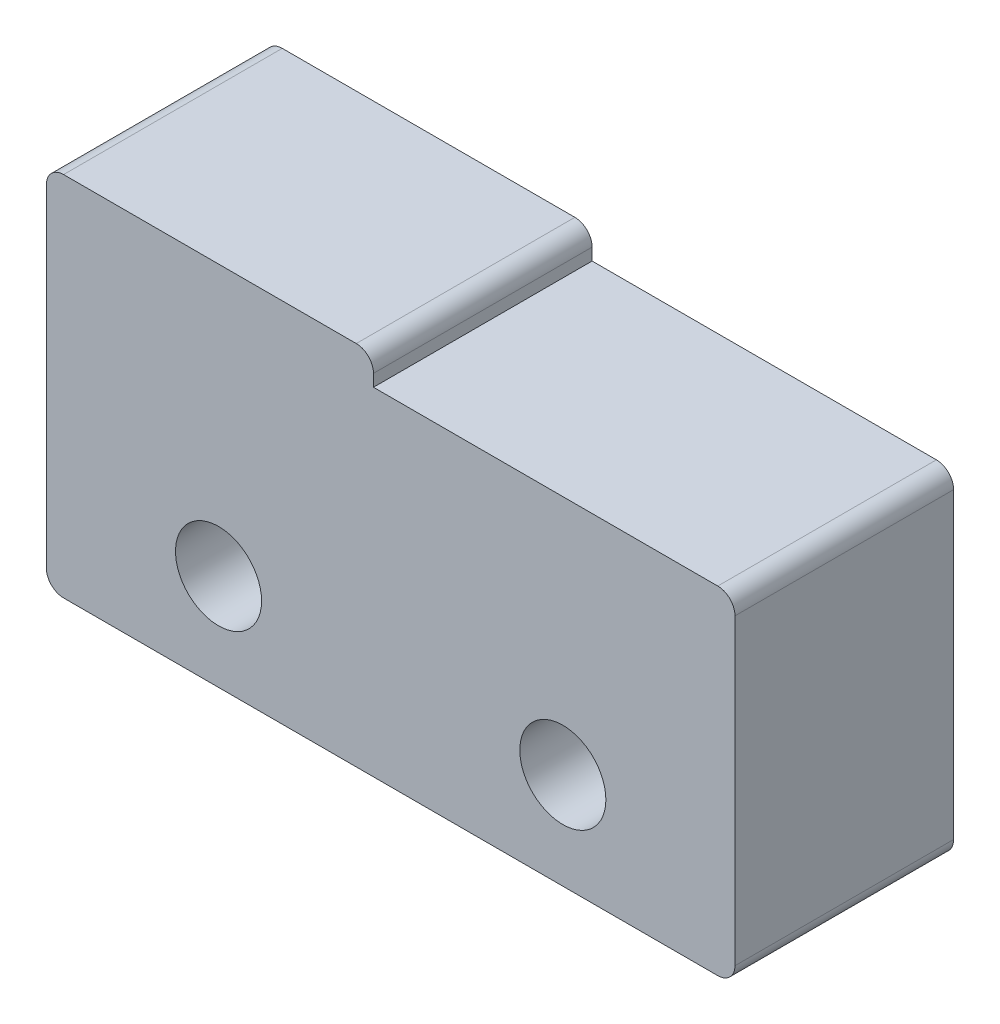
ISO-10303-21;
HEADER;
FILE_DESCRIPTION(('STEP AP214'),'2;1');
FILE_NAME('part.step','',(''),(''),'','','');
FILE_SCHEMA(('AUTOMOTIVE_DESIGN { 1 0 10303 214 1 1 1 1 }'));
ENDSEC;
DATA;
#1=APPLICATION_CONTEXT('core data for automotive mechanical design processes');
#2=APPLICATION_PROTOCOL_DEFINITION('international standard','automotive_design',2000,#1);
#3=PRODUCT_CONTEXT('',#1,'mechanical');
#4=PRODUCT('Part','Part','',(#3));
#5=PRODUCT_RELATED_PRODUCT_CATEGORY('part','',(#4));
#6=PRODUCT_DEFINITION_FORMATION('','',#4);
#7=PRODUCT_DEFINITION_CONTEXT('part definition',#1,'design');
#8=PRODUCT_DEFINITION('design','',#6,#7);
#9=PRODUCT_DEFINITION_SHAPE('','',#8);
#10=(LENGTH_UNIT() NAMED_UNIT(*) SI_UNIT(.MILLI.,.METRE.));
#11=(NAMED_UNIT(*) PLANE_ANGLE_UNIT() SI_UNIT($,.RADIAN.));
#12=(NAMED_UNIT(*) SI_UNIT($,.STERADIAN.) SOLID_ANGLE_UNIT());
#13=UNCERTAINTY_MEASURE_WITH_UNIT(LENGTH_MEASURE(1.E-05),#10,'distance_accuracy_value','');
#14=(GEOMETRIC_REPRESENTATION_CONTEXT(3) GLOBAL_UNCERTAINTY_ASSIGNED_CONTEXT((#13)) GLOBAL_UNIT_ASSIGNED_CONTEXT((#10,
#11,#12)) REPRESENTATION_CONTEXT('',''));
#15=CARTESIAN_POINT('',(0.,0.,0.));
#16=DIRECTION('',(0.,0.,1.));
#17=DIRECTION('',(1.,0.,0.));
#18=AXIS2_PLACEMENT_3D('',#15,#16,#17);
#19=CARTESIAN_POINT('',(0.,0.,6.35));
#20=DIRECTION('',(0.,0.,-1.));
#21=DIRECTION('',(-1.,0.,0.));
#22=AXIS2_PLACEMENT_3D('',#19,#20,#21);
#23=PLANE('',#22);
#24=CARTESIAN_POINT('',(-5.,-2.2,6.35));
#25=DIRECTION('',(0.,0.,1.));
#26=DIRECTION('',(1.,0.,0.));
#27=AXIS2_PLACEMENT_3D('',#24,#25,#26);
#28=CIRCLE('',#27,1.25);
#29=CARTESIAN_POINT('',(-3.75,-2.2,6.35));
#30=VERTEX_POINT('',#29);
#31=EDGE_CURVE('E148',#30,#30,#28,.T.);
#32=ORIENTED_EDGE('',*,*,#31,.F.);
#33=EDGE_LOOP('',(#32));
#34=FACE_BOUND('',#33,.T.);
#35=DIRECTION('',(1.,0.,0.));
#36=VECTOR('',#35,1.);
#37=CARTESIAN_POINT('',(10.,-5.,6.35));
#38=LINE('',#37,#36);
#39=CARTESIAN_POINT('',(-9.5,-5.,6.35));
#40=VERTEX_POINT('',#39);
#41=CARTESIAN_POINT('',(9.5,-5.,6.35));
#42=VERTEX_POINT('',#41);
#43=EDGE_CURVE('E215',#40,#42,#38,.T.);
#44=ORIENTED_EDGE('',*,*,#43,.T.);
#45=CARTESIAN_POINT('',(9.5,-4.5,6.35));
#46=DIRECTION('',(0.,0.,-1.));
#47=DIRECTION('',(-1.,0.,0.));
#48=AXIS2_PLACEMENT_3D('',#45,#46,#47);
#49=CIRCLE('',#48,0.5);
#50=CARTESIAN_POINT('',(10.,-4.5,6.35));
#51=VERTEX_POINT('',#50);
#52=EDGE_CURVE('E185',#42,#51,#49,.F.);
#53=ORIENTED_EDGE('',*,*,#52,.T.);
#54=DIRECTION('',(0.,1.,0.));
#55=VECTOR('',#54,1.);
#56=CARTESIAN_POINT('',(10.,4.8,6.35));
#57=LINE('',#56,#55);
#58=CARTESIAN_POINT('',(10.,4.3,6.35));
#59=VERTEX_POINT('',#58);
#60=EDGE_CURVE('E125',#51,#59,#57,.T.);
#61=ORIENTED_EDGE('',*,*,#60,.T.);
#62=CARTESIAN_POINT('',(9.5,4.3,6.35));
#63=DIRECTION('',(0.,0.,-1.));
#64=DIRECTION('',(-1.,0.,0.));
#65=AXIS2_PLACEMENT_3D('',#62,#63,#64);
#66=CIRCLE('',#65,0.5);
#67=CARTESIAN_POINT('',(9.5,4.8,6.35));
#68=VERTEX_POINT('',#67);
#69=EDGE_CURVE('E121',#59,#68,#66,.F.);
#70=ORIENTED_EDGE('',*,*,#69,.T.);
#71=DIRECTION('',(-1.,0.,0.));
#72=VECTOR('',#71,1.);
#73=CARTESIAN_POINT('',(10.,4.8,6.35));
#74=LINE('',#73,#72);
#75=CARTESIAN_POINT('',(-0.5,4.8,6.35));
#76=VERTEX_POINT('',#75);
#77=EDGE_CURVE('E113',#68,#76,#74,.T.);
#78=ORIENTED_EDGE('',*,*,#77,.T.);
#79=DIRECTION('',(0.,1.,0.));
#80=VECTOR('',#79,1.);
#81=CARTESIAN_POINT('',(-0.5,5.65,6.35));
#82=LINE('',#81,#80);
#83=CARTESIAN_POINT('',(-0.5,5.15,6.35));
#84=VERTEX_POINT('',#83);
#85=EDGE_CURVE('E118',#76,#84,#82,.T.);
#86=ORIENTED_EDGE('',*,*,#85,.T.);
#87=CARTESIAN_POINT('',(-1.,5.15,6.35));
#88=DIRECTION('',(0.,0.,-1.));
#89=DIRECTION('',(-1.,0.,0.));
#90=AXIS2_PLACEMENT_3D('',#87,#88,#89);
#91=CIRCLE('',#90,0.5);
#92=CARTESIAN_POINT('',(-1.,5.65,6.35));
#93=VERTEX_POINT('',#92);
#94=EDGE_CURVE('E53',#84,#93,#91,.F.);
#95=ORIENTED_EDGE('',*,*,#94,.T.);
#96=DIRECTION('',(-1.,0.,0.));
#97=VECTOR('',#96,1.);
#98=CARTESIAN_POINT('',(-0.5,5.65,6.35));
#99=LINE('',#98,#97);
#100=CARTESIAN_POINT('',(-9.5,5.65,6.35));
#101=VERTEX_POINT('',#100);
#102=EDGE_CURVE('E136',#93,#101,#99,.T.);
#103=ORIENTED_EDGE('',*,*,#102,.T.);
#104=CARTESIAN_POINT('',(-9.5,5.15,6.35));
#105=DIRECTION('',(0.,0.,-1.));
#106=DIRECTION('',(-1.,0.,0.));
#107=AXIS2_PLACEMENT_3D('',#104,#105,#106);
#108=CIRCLE('',#107,0.5);
#109=CARTESIAN_POINT('',(-10.,5.15,6.35));
#110=VERTEX_POINT('',#109);
#111=EDGE_CURVE('E180',#101,#110,#108,.F.);
#112=ORIENTED_EDGE('',*,*,#111,.T.);
#113=DIRECTION('',(0.,-1.,0.));
#114=VECTOR('',#113,1.);
#115=CARTESIAN_POINT('',(-10.,5.65,6.35));
#116=LINE('',#115,#114);
#117=CARTESIAN_POINT('',(-10.,-4.5,6.35));
#118=VERTEX_POINT('',#117);
#119=EDGE_CURVE('E158',#110,#118,#116,.T.);
#120=ORIENTED_EDGE('',*,*,#119,.T.);
#121=CARTESIAN_POINT('',(-9.5,-4.5,6.35));
#122=DIRECTION('',(0.,0.,-1.));
#123=DIRECTION('',(-1.,0.,0.));
#124=AXIS2_PLACEMENT_3D('',#121,#122,#123);
#125=CIRCLE('',#124,0.5);
#126=EDGE_CURVE('E182',#118,#40,#125,.F.);
#127=ORIENTED_EDGE('',*,*,#126,.T.);
#128=EDGE_LOOP('',(#44,#53,#61,#70,#78,#86,#95,#103,#112,#120,#127));
#129=FACE_BOUND('',#128,.T.);
#130=CARTESIAN_POINT('',(5.,-2.2,6.35));
#131=DIRECTION('',(0.,0.,1.));
#132=DIRECTION('',(1.,0.,0.));
#133=AXIS2_PLACEMENT_3D('',#130,#131,#132);
#134=CIRCLE('',#133,1.25);
#135=CARTESIAN_POINT('',(6.25,-2.2,6.35));
#136=VERTEX_POINT('',#135);
#137=EDGE_CURVE('E368',#136,#136,#134,.T.);
#138=ORIENTED_EDGE('',*,*,#137,.F.);
#139=EDGE_LOOP('',(#138));
#140=FACE_BOUND('',#139,.T.);
#141=ADVANCED_FACE('F32',(#34,#129,#140),#23,.F.);
#142=CARTESIAN_POINT('',(0.,0.,0.));
#143=DIRECTION('',(0.,0.,-1.));
#144=DIRECTION('',(-1.,0.,0.));
#145=AXIS2_PLACEMENT_3D('',#142,#143,#144);
#146=PLANE('',#145);
#147=CARTESIAN_POINT('',(-5.,-2.2,0.));
#148=DIRECTION('',(0.,0.,1.));
#149=DIRECTION('',(1.,0.,0.));
#150=AXIS2_PLACEMENT_3D('',#147,#148,#149);
#151=CIRCLE('',#150,1.25);
#152=CARTESIAN_POINT('',(-3.75,-2.2,0.));
#153=VERTEX_POINT('',#152);
#154=EDGE_CURVE('E219',#153,#153,#151,.T.);
#155=ORIENTED_EDGE('',*,*,#154,.T.);
#156=EDGE_LOOP('',(#155));
#157=FACE_BOUND('',#156,.T.);
#158=DIRECTION('',(0.,1.,0.));
#159=VECTOR('',#158,1.);
#160=CARTESIAN_POINT('',(10.,4.8,0.));
#161=LINE('',#160,#159);
#162=CARTESIAN_POINT('',(10.,-4.5,0.));
#163=VERTEX_POINT('',#162);
#164=CARTESIAN_POINT('',(10.,4.3,0.));
#165=VERTEX_POINT('',#164);
#166=EDGE_CURVE('E151',#163,#165,#161,.T.);
#167=ORIENTED_EDGE('',*,*,#166,.F.);
#168=CARTESIAN_POINT('',(9.5,-4.5,0.));
#169=DIRECTION('',(0.,0.,-1.));
#170=DIRECTION('',(-1.,0.,0.));
#171=AXIS2_PLACEMENT_3D('',#168,#169,#170);
#172=CIRCLE('',#171,0.5);
#173=CARTESIAN_POINT('',(9.5,-5.,0.));
#174=VERTEX_POINT('',#173);
#175=EDGE_CURVE('E172',#163,#174,#172,.T.);
#176=ORIENTED_EDGE('',*,*,#175,.T.);
#177=DIRECTION('',(1.,0.,0.));
#178=VECTOR('',#177,1.);
#179=CARTESIAN_POINT('',(10.,-5.,0.));
#180=LINE('',#179,#178);
#181=CARTESIAN_POINT('',(-9.5,-5.,0.));
#182=VERTEX_POINT('',#181);
#183=EDGE_CURVE('E147',#182,#174,#180,.T.);
#184=ORIENTED_EDGE('',*,*,#183,.F.);
#185=CARTESIAN_POINT('',(-9.5,-4.5,0.));
#186=DIRECTION('',(0.,0.,-1.));
#187=DIRECTION('',(-1.,0.,0.));
#188=AXIS2_PLACEMENT_3D('',#185,#186,#187);
#189=CIRCLE('',#188,0.5);
#190=CARTESIAN_POINT('',(-10.,-4.5,0.));
#191=VERTEX_POINT('',#190);
#192=EDGE_CURVE('E168',#182,#191,#189,.T.);
#193=ORIENTED_EDGE('',*,*,#192,.T.);
#194=DIRECTION('',(0.,-1.,0.));
#195=VECTOR('',#194,1.);
#196=CARTESIAN_POINT('',(-10.,5.65,0.));
#197=LINE('',#196,#195);
#198=CARTESIAN_POINT('',(-10.,5.15,0.));
#199=VERTEX_POINT('',#198);
#200=EDGE_CURVE('E144',#199,#191,#197,.T.);
#201=ORIENTED_EDGE('',*,*,#200,.F.);
#202=CARTESIAN_POINT('',(-9.5,5.15,0.));
#203=DIRECTION('',(0.,0.,-1.));
#204=DIRECTION('',(-1.,0.,0.));
#205=AXIS2_PLACEMENT_3D('',#202,#203,#204);
#206=CIRCLE('',#205,0.5);
#207=CARTESIAN_POINT('',(-9.5,5.65,0.));
#208=VERTEX_POINT('',#207);
#209=EDGE_CURVE('E166',#199,#208,#206,.T.);
#210=ORIENTED_EDGE('',*,*,#209,.T.);
#211=DIRECTION('',(-1.,0.,0.));
#212=VECTOR('',#211,1.);
#213=CARTESIAN_POINT('',(-0.5,5.65,0.));
#214=LINE('',#213,#212);
#215=CARTESIAN_POINT('',(-1.,5.65,0.));
#216=VERTEX_POINT('',#215);
#217=EDGE_CURVE('E157',#216,#208,#214,.T.);
#218=ORIENTED_EDGE('',*,*,#217,.F.);
#219=CARTESIAN_POINT('',(-1.,5.15,0.));
#220=DIRECTION('',(0.,0.,-1.));
#221=DIRECTION('',(-1.,0.,0.));
#222=AXIS2_PLACEMENT_3D('',#219,#220,#221);
#223=CIRCLE('',#222,0.5);
#224=CARTESIAN_POINT('',(-0.5,5.15,0.));
#225=VERTEX_POINT('',#224);
#226=EDGE_CURVE('E164',#216,#225,#223,.T.);
#227=ORIENTED_EDGE('',*,*,#226,.T.);
#228=DIRECTION('',(0.,1.,0.));
#229=VECTOR('',#228,1.);
#230=CARTESIAN_POINT('',(-0.5,5.65,0.));
#231=LINE('',#230,#229);
#232=CARTESIAN_POINT('',(-0.5,4.8,0.));
#233=VERTEX_POINT('',#232);
#234=EDGE_CURVE('E155',#233,#225,#231,.T.);
#235=ORIENTED_EDGE('',*,*,#234,.F.);
#236=DIRECTION('',(-1.,0.,0.));
#237=VECTOR('',#236,1.);
#238=CARTESIAN_POINT('',(10.,4.8,0.));
#239=LINE('',#238,#237);
#240=CARTESIAN_POINT('',(9.5,4.8,0.));
#241=VERTEX_POINT('',#240);
#242=EDGE_CURVE('E131',#241,#233,#239,.T.);
#243=ORIENTED_EDGE('',*,*,#242,.F.);
#244=CARTESIAN_POINT('',(9.5,4.3,0.));
#245=DIRECTION('',(0.,0.,-1.));
#246=DIRECTION('',(-1.,0.,0.));
#247=AXIS2_PLACEMENT_3D('',#244,#245,#246);
#248=CIRCLE('',#247,0.5);
#249=EDGE_CURVE('E170',#241,#165,#248,.T.);
#250=ORIENTED_EDGE('',*,*,#249,.T.);
#251=EDGE_LOOP('',(#167,#176,#184,#193,#201,#210,#218,#227,#235,#243,#250));
#252=FACE_BOUND('',#251,.T.);
#253=CARTESIAN_POINT('',(5.,-2.2,0.));
#254=DIRECTION('',(0.,0.,1.));
#255=DIRECTION('',(1.,0.,0.));
#256=AXIS2_PLACEMENT_3D('',#253,#254,#255);
#257=CIRCLE('',#256,1.25);
#258=CARTESIAN_POINT('',(6.25,-2.2,0.));
#259=VERTEX_POINT('',#258);
#260=EDGE_CURVE('E370',#259,#259,#257,.T.);
#261=ORIENTED_EDGE('',*,*,#260,.T.);
#262=EDGE_LOOP('',(#261));
#263=FACE_BOUND('',#262,.T.);
#264=ADVANCED_FACE('F202',(#157,#252,#263),#146,.T.);
#265=CARTESIAN_POINT('',(-10.,5.65,6.35));
#266=DIRECTION('',(1.,0.,0.));
#267=DIRECTION('',(0.,0.,-1.));
#268=AXIS2_PLACEMENT_3D('',#265,#266,#267);
#269=PLANE('',#268);
#270=ORIENTED_EDGE('',*,*,#200,.T.);
#271=DIRECTION('',(0.,0.,-1.));
#272=VECTOR('',#271,1.);
#273=CARTESIAN_POINT('',(-10.,-4.5,6.35));
#274=LINE('',#273,#272);
#275=EDGE_CURVE('E192',#191,#118,#274,.F.);
#276=ORIENTED_EDGE('',*,*,#275,.T.);
#277=ORIENTED_EDGE('',*,*,#119,.F.);
#278=DIRECTION('',(0.,0.,-1.));
#279=VECTOR('',#278,1.);
#280=CARTESIAN_POINT('',(-10.,5.15,6.35));
#281=LINE('',#280,#279);
#282=EDGE_CURVE('E189',#110,#199,#281,.T.);
#283=ORIENTED_EDGE('',*,*,#282,.T.);
#284=EDGE_LOOP('',(#270,#276,#277,#283));
#285=FACE_BOUND('',#284,.T.);
#286=ADVANCED_FACE('F211',(#285),#269,.F.);
#287=CARTESIAN_POINT('',(10.,-5.,6.35));
#288=DIRECTION('',(0.,1.,0.));
#289=DIRECTION('',(-1.,0.,0.));
#290=AXIS2_PLACEMENT_3D('',#287,#288,#289);
#291=PLANE('',#290);
#292=ORIENTED_EDGE('',*,*,#183,.T.);
#293=DIRECTION('',(0.,0.,-1.));
#294=VECTOR('',#293,1.);
#295=CARTESIAN_POINT('',(9.5,-5.,6.35));
#296=LINE('',#295,#294);
#297=EDGE_CURVE('E177',#174,#42,#296,.F.);
#298=ORIENTED_EDGE('',*,*,#297,.T.);
#299=ORIENTED_EDGE('',*,*,#43,.F.);
#300=DIRECTION('',(0.,0.,-1.));
#301=VECTOR('',#300,1.);
#302=CARTESIAN_POINT('',(-9.5,-5.,6.35));
#303=LINE('',#302,#301);
#304=EDGE_CURVE('E174',#40,#182,#303,.T.);
#305=ORIENTED_EDGE('',*,*,#304,.T.);
#306=EDGE_LOOP('',(#292,#298,#299,#305));
#307=FACE_BOUND('',#306,.T.);
#308=ADVANCED_FACE('F255',(#307),#291,.F.);
#309=CARTESIAN_POINT('',(10.,4.8,6.35));
#310=DIRECTION('',(-1.,0.,0.));
#311=DIRECTION('',(0.,0.,1.));
#312=AXIS2_PLACEMENT_3D('',#309,#310,#311);
#313=PLANE('',#312);
#314=ORIENTED_EDGE('',*,*,#60,.F.);
#315=DIRECTION('',(0.,0.,-1.));
#316=VECTOR('',#315,1.);
#317=CARTESIAN_POINT('',(10.,-4.5,6.35));
#318=LINE('',#317,#316);
#319=EDGE_CURVE('E161',#51,#163,#318,.T.);
#320=ORIENTED_EDGE('',*,*,#319,.T.);
#321=ORIENTED_EDGE('',*,*,#166,.T.);
#322=DIRECTION('',(0.,0.,-1.));
#323=VECTOR('',#322,1.);
#324=CARTESIAN_POINT('',(10.,4.3,6.35));
#325=LINE('',#324,#323);
#326=EDGE_CURVE('E135',#165,#59,#325,.F.);
#327=ORIENTED_EDGE('',*,*,#326,.T.);
#328=EDGE_LOOP('',(#314,#320,#321,#327));
#329=FACE_BOUND('',#328,.T.);
#330=ADVANCED_FACE('F252',(#329),#313,.F.);
#331=CARTESIAN_POINT('',(10.,4.8,6.35));
#332=DIRECTION('',(0.,-1.,0.));
#333=DIRECTION('',(0.,0.,-1.));
#334=AXIS2_PLACEMENT_3D('',#331,#332,#333);
#335=PLANE('',#334);
#336=ORIENTED_EDGE('',*,*,#77,.F.);
#337=DIRECTION('',(0.,0.,-1.));
#338=VECTOR('',#337,1.);
#339=CARTESIAN_POINT('',(9.5,4.8,6.35));
#340=LINE('',#339,#338);
#341=EDGE_CURVE('E187',#68,#241,#340,.T.);
#342=ORIENTED_EDGE('',*,*,#341,.T.);
#343=ORIENTED_EDGE('',*,*,#242,.T.);
#344=DIRECTION('',(0.,0.,-1.));
#345=VECTOR('',#344,1.);
#346=CARTESIAN_POINT('',(-0.5,4.8,6.35));
#347=LINE('',#346,#345);
#348=EDGE_CURVE('E128',#76,#233,#347,.T.);
#349=ORIENTED_EDGE('',*,*,#348,.F.);
#350=EDGE_LOOP('',(#336,#342,#343,#349));
#351=FACE_BOUND('',#350,.T.);
#352=ADVANCED_FACE('F129',(#351),#335,.F.);
#353=CARTESIAN_POINT('',(-0.5,5.65,6.35));
#354=DIRECTION('',(-1.,0.,0.));
#355=DIRECTION('',(0.,0.,1.));
#356=AXIS2_PLACEMENT_3D('',#353,#354,#355);
#357=PLANE('',#356);
#358=ORIENTED_EDGE('',*,*,#234,.T.);
#359=DIRECTION('',(0.,0.,-1.));
#360=VECTOR('',#359,1.);
#361=CARTESIAN_POINT('',(-0.5,5.15,6.35));
#362=LINE('',#361,#360);
#363=EDGE_CURVE('E11',#225,#84,#362,.F.);
#364=ORIENTED_EDGE('',*,*,#363,.T.);
#365=ORIENTED_EDGE('',*,*,#85,.F.);
#366=ORIENTED_EDGE('',*,*,#348,.T.);
#367=EDGE_LOOP('',(#358,#364,#365,#366));
#368=FACE_BOUND('',#367,.T.);
#369=ADVANCED_FACE('F138',(#368),#357,.F.);
#370=CARTESIAN_POINT('',(-0.5,5.65,6.35));
#371=DIRECTION('',(0.,-1.,0.));
#372=DIRECTION('',(0.,0.,-1.));
#373=AXIS2_PLACEMENT_3D('',#370,#371,#372);
#374=PLANE('',#373);
#375=ORIENTED_EDGE('',*,*,#217,.T.);
#376=DIRECTION('',(0.,0.,-1.));
#377=VECTOR('',#376,1.);
#378=CARTESIAN_POINT('',(-9.5,5.65,6.35));
#379=LINE('',#378,#377);
#380=EDGE_CURVE('E40',#208,#101,#379,.F.);
#381=ORIENTED_EDGE('',*,*,#380,.T.);
#382=ORIENTED_EDGE('',*,*,#102,.F.);
#383=DIRECTION('',(0.,0.,-1.));
#384=VECTOR('',#383,1.);
#385=CARTESIAN_POINT('',(-1.,5.65,6.35));
#386=LINE('',#385,#384);
#387=EDGE_CURVE('E194',#93,#216,#386,.T.);
#388=ORIENTED_EDGE('',*,*,#387,.T.);
#389=EDGE_LOOP('',(#375,#381,#382,#388));
#390=FACE_BOUND('',#389,.T.);
#391=ADVANCED_FACE('F198',(#390),#374,.F.);
#392=CARTESIAN_POINT('',(-5.,-2.2,6.35));
#393=DIRECTION('',(0.,0.,-1.));
#394=DIRECTION('',(-1.,0.,0.));
#395=AXIS2_PLACEMENT_3D('',#392,#393,#394);
#396=CYLINDRICAL_SURFACE('',#395,1.25);
#397=ORIENTED_EDGE('',*,*,#31,.T.);
#398=EDGE_LOOP('',(#397));
#399=FACE_BOUND('',#398,.T.);
#400=ORIENTED_EDGE('',*,*,#154,.F.);
#401=EDGE_LOOP('',(#400));
#402=FACE_BOUND('',#401,.T.);
#403=ADVANCED_FACE('F243',(#399,#402),#396,.F.);
#404=CARTESIAN_POINT('',(5.,-2.2,6.35));
#405=DIRECTION('',(0.,0.,-1.));
#406=DIRECTION('',(-1.,0.,0.));
#407=AXIS2_PLACEMENT_3D('',#404,#405,#406);
#408=CYLINDRICAL_SURFACE('',#407,1.25);
#409=ORIENTED_EDGE('',*,*,#137,.T.);
#410=EDGE_LOOP('',(#409));
#411=FACE_BOUND('',#410,.T.);
#412=ORIENTED_EDGE('',*,*,#260,.F.);
#413=EDGE_LOOP('',(#412));
#414=FACE_BOUND('',#413,.T.);
#415=ADVANCED_FACE('F264',(#411,#414),#408,.F.);
#416=CARTESIAN_POINT('',(9.5,-4.5,6.35));
#417=DIRECTION('',(0.,0.,-1.));
#418=DIRECTION('',(-1.,0.,0.));
#419=AXIS2_PLACEMENT_3D('',#416,#417,#418);
#420=CYLINDRICAL_SURFACE('',#419,0.5);
#421=ORIENTED_EDGE('',*,*,#52,.F.);
#422=ORIENTED_EDGE('',*,*,#297,.F.);
#423=ORIENTED_EDGE('',*,*,#175,.F.);
#424=ORIENTED_EDGE('',*,*,#319,.F.);
#425=EDGE_LOOP('',(#421,#422,#423,#424));
#426=FACE_BOUND('',#425,.T.);
#427=ADVANCED_FACE('F261',(#426),#420,.T.);
#428=CARTESIAN_POINT('',(9.5,4.3,6.35));
#429=DIRECTION('',(0.,0.,-1.));
#430=DIRECTION('',(-1.,0.,0.));
#431=AXIS2_PLACEMENT_3D('',#428,#429,#430);
#432=CYLINDRICAL_SURFACE('',#431,0.5);
#433=ORIENTED_EDGE('',*,*,#69,.F.);
#434=ORIENTED_EDGE('',*,*,#326,.F.);
#435=ORIENTED_EDGE('',*,*,#249,.F.);
#436=ORIENTED_EDGE('',*,*,#341,.F.);
#437=EDGE_LOOP('',(#433,#434,#435,#436));
#438=FACE_BOUND('',#437,.T.);
#439=ADVANCED_FACE('F227',(#438),#432,.T.);
#440=CARTESIAN_POINT('',(-9.5,-4.5,6.35));
#441=DIRECTION('',(0.,0.,-1.));
#442=DIRECTION('',(-1.,0.,0.));
#443=AXIS2_PLACEMENT_3D('',#440,#441,#442);
#444=CYLINDRICAL_SURFACE('',#443,0.5);
#445=ORIENTED_EDGE('',*,*,#126,.F.);
#446=ORIENTED_EDGE('',*,*,#275,.F.);
#447=ORIENTED_EDGE('',*,*,#192,.F.);
#448=ORIENTED_EDGE('',*,*,#304,.F.);
#449=EDGE_LOOP('',(#445,#446,#447,#448));
#450=FACE_BOUND('',#449,.T.);
#451=ADVANCED_FACE('F232',(#450),#444,.T.);
#452=CARTESIAN_POINT('',(-9.5,5.15,6.35));
#453=DIRECTION('',(0.,0.,-1.));
#454=DIRECTION('',(-1.,0.,0.));
#455=AXIS2_PLACEMENT_3D('',#452,#453,#454);
#456=CYLINDRICAL_SURFACE('',#455,0.5);
#457=ORIENTED_EDGE('',*,*,#111,.F.);
#458=ORIENTED_EDGE('',*,*,#380,.F.);
#459=ORIENTED_EDGE('',*,*,#209,.F.);
#460=ORIENTED_EDGE('',*,*,#282,.F.);
#461=EDGE_LOOP('',(#457,#458,#459,#460));
#462=FACE_BOUND('',#461,.T.);
#463=ADVANCED_FACE('F208',(#462),#456,.T.);
#464=CARTESIAN_POINT('',(-1.,5.15,6.35));
#465=DIRECTION('',(0.,0.,-1.));
#466=DIRECTION('',(-1.,0.,0.));
#467=AXIS2_PLACEMENT_3D('',#464,#465,#466);
#468=CYLINDRICAL_SURFACE('',#467,0.5);
#469=ORIENTED_EDGE('',*,*,#94,.F.);
#470=ORIENTED_EDGE('',*,*,#363,.F.);
#471=ORIENTED_EDGE('',*,*,#226,.F.);
#472=ORIENTED_EDGE('',*,*,#387,.F.);
#473=EDGE_LOOP('',(#469,#470,#471,#472));
#474=FACE_BOUND('',#473,.T.);
#475=ADVANCED_FACE('F34',(#474),#468,.T.);
#476=CLOSED_SHELL('',(#141,#264,#286,#308,#330,#352,#369,#391,#403,#415,#427,#439,#451,#463,#475));
#477=MANIFOLD_SOLID_BREP('B2',#476);
#478=ADVANCED_BREP_SHAPE_REPRESENTATION('',(#18,#477),#14);
#479=SHAPE_DEFINITION_REPRESENTATION(#9,#478);
ENDSEC;
END-ISO-10303-21;
